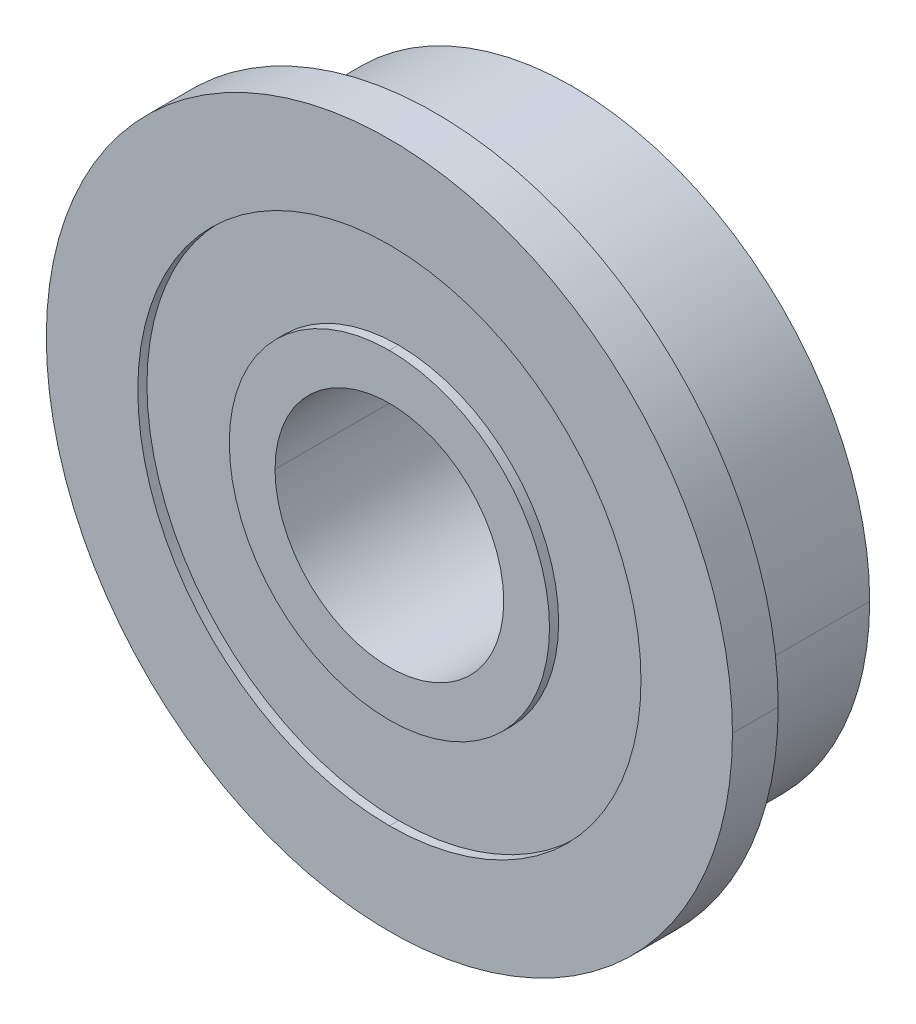
ISO-10303-21;
HEADER;
FILE_DESCRIPTION(('STEP AP214'),'2;1');
FILE_NAME('part.step','',(''),(''),'','','');
FILE_SCHEMA(('AUTOMOTIVE_DESIGN { 1 0 10303 214 1 1 1 1 }'));
ENDSEC;
DATA;
#1=APPLICATION_CONTEXT('core data for automotive mechanical design processes');
#2=APPLICATION_PROTOCOL_DEFINITION('international standard','automotive_design',2000,#1);
#3=PRODUCT_CONTEXT('',#1,'mechanical');
#4=PRODUCT('Part','Part','',(#3));
#5=PRODUCT_RELATED_PRODUCT_CATEGORY('part','',(#4));
#6=PRODUCT_DEFINITION_FORMATION('','',#4);
#7=PRODUCT_DEFINITION_CONTEXT('part definition',#1,'design');
#8=PRODUCT_DEFINITION('design','',#6,#7);
#9=PRODUCT_DEFINITION_SHAPE('','',#8);
#10=(LENGTH_UNIT() NAMED_UNIT(*) SI_UNIT(.MILLI.,.METRE.));
#11=(NAMED_UNIT(*) PLANE_ANGLE_UNIT() SI_UNIT($,.RADIAN.));
#12=(NAMED_UNIT(*) SI_UNIT($,.STERADIAN.) SOLID_ANGLE_UNIT());
#13=UNCERTAINTY_MEASURE_WITH_UNIT(LENGTH_MEASURE(1.E-05),#10,'distance_accuracy_value','');
#14=(GEOMETRIC_REPRESENTATION_CONTEXT(3) GLOBAL_UNCERTAINTY_ASSIGNED_CONTEXT((#13)) GLOBAL_UNIT_ASSIGNED_CONTEXT((#10,
#11,#12)) REPRESENTATION_CONTEXT('',''));
#15=CARTESIAN_POINT('',(0.,0.,0.));
#16=DIRECTION('',(0.,0.,1.));
#17=DIRECTION('',(1.,0.,0.));
#18=AXIS2_PLACEMENT_3D('',#15,#16,#17);
#19=CARTESIAN_POINT('',(0.,0.,2.));
#20=DIRECTION('',(0.,0.,-1.));
#21=DIRECTION('',(0.,1.,0.));
#22=AXIS2_PLACEMENT_3D('',#19,#20,#21);
#23=CYLINDRICAL_SURFACE('',#22,5.5);
#24=DIRECTION('',(0.,0.,1.));
#25=VECTOR('',#24,1.);
#26=CARTESIAN_POINT('',(0.,-5.5,1.8));
#27=LINE('',#26,#25);
#28=CARTESIAN_POINT('',(0.,-5.5,1.8));
#29=VERTEX_POINT('',#28);
#30=CARTESIAN_POINT('',(0.,-5.5,2.));
#31=VERTEX_POINT('',#30);
#32=EDGE_CURVE('E18',#29,#31,#27,.T.);
#33=ORIENTED_EDGE('',*,*,#32,.T.);
#34=CARTESIAN_POINT('',(0.,0.,2.));
#35=DIRECTION('',(0.,0.,-1.));
#36=DIRECTION('',(0.,1.,0.));
#37=AXIS2_PLACEMENT_3D('',#34,#35,#36);
#38=CIRCLE('',#37,5.5);
#39=CARTESIAN_POINT('',(0.,5.5,2.));
#40=VERTEX_POINT('',#39);
#41=EDGE_CURVE('E188',#40,#31,#38,.T.);
#42=ORIENTED_EDGE('',*,*,#41,.F.);
#43=DIRECTION('',(0.,0.,1.));
#44=VECTOR('',#43,1.);
#45=CARTESIAN_POINT('',(0.,5.5,1.8));
#46=LINE('',#45,#44);
#47=CARTESIAN_POINT('',(0.,5.5,1.8));
#48=VERTEX_POINT('',#47);
#49=EDGE_CURVE('E198',#48,#40,#46,.T.);
#50=ORIENTED_EDGE('',*,*,#49,.F.);
#51=CARTESIAN_POINT('',(0.,0.,1.8));
#52=DIRECTION('',(0.,0.,1.));
#53=DIRECTION('',(0.,-1.,0.));
#54=AXIS2_PLACEMENT_3D('',#51,#52,#53);
#55=CIRCLE('',#54,5.5);
#56=EDGE_CURVE('E191',#29,#48,#55,.T.);
#57=ORIENTED_EDGE('',*,*,#56,.F.);
#58=EDGE_LOOP('',(#33,#42,#50,#57));
#59=FACE_BOUND('',#58,.T.);
#60=ADVANCED_FACE('F15',(#59),#23,.F.);
#61=CARTESIAN_POINT('',(0.,0.,-2.));
#62=DIRECTION('',(0.,0.,1.));
#63=DIRECTION('',(1.,0.,0.));
#64=AXIS2_PLACEMENT_3D('',#61,#62,#63);
#65=CYLINDRICAL_SURFACE('',#64,2.5);
#66=CARTESIAN_POINT('',(0.,0.,2.));
#67=DIRECTION('',(0.,0.,-1.));
#68=DIRECTION('',(1.,0.,0.));
#69=AXIS2_PLACEMENT_3D('',#66,#67,#68);
#70=CIRCLE('',#69,2.5);
#71=CARTESIAN_POINT('',(2.5,0.,2.));
#72=VERTEX_POINT('',#71);
#73=CARTESIAN_POINT('',(-2.5,0.,2.));
#74=VERTEX_POINT('',#73);
#75=EDGE_CURVE('E165',#72,#74,#70,.T.);
#76=ORIENTED_EDGE('',*,*,#75,.F.);
#77=DIRECTION('',(0.,0.,-1.));
#78=VECTOR('',#77,1.);
#79=CARTESIAN_POINT('',(2.5,0.,2.));
#80=LINE('',#79,#78);
#81=CARTESIAN_POINT('',(2.5,0.,-2.));
#82=VERTEX_POINT('',#81);
#83=EDGE_CURVE('E24',#72,#82,#80,.T.);
#84=ORIENTED_EDGE('',*,*,#83,.T.);
#85=CARTESIAN_POINT('',(0.,0.,-2.));
#86=DIRECTION('',(0.,0.,1.));
#87=DIRECTION('',(-1.,0.,0.));
#88=AXIS2_PLACEMENT_3D('',#85,#86,#87);
#89=CIRCLE('',#88,2.5);
#90=CARTESIAN_POINT('',(-2.5,0.,-2.));
#91=VERTEX_POINT('',#90);
#92=EDGE_CURVE('E156',#91,#82,#89,.T.);
#93=ORIENTED_EDGE('',*,*,#92,.F.);
#94=DIRECTION('',(0.,0.,-1.));
#95=VECTOR('',#94,1.);
#96=CARTESIAN_POINT('',(-2.5,0.,2.));
#97=LINE('',#96,#95);
#98=EDGE_CURVE('E10',#74,#91,#97,.T.);
#99=ORIENTED_EDGE('',*,*,#98,.F.);
#100=EDGE_LOOP('',(#76,#84,#93,#99));
#101=FACE_BOUND('',#100,.T.);
#102=ADVANCED_FACE('F163',(#101),#65,.F.);
#103=CARTESIAN_POINT('',(0.,0.,-2.));
#104=DIRECTION('',(0.,0.,1.));
#105=DIRECTION('',(1.,0.,0.));
#106=AXIS2_PLACEMENT_3D('',#103,#104,#105);
#107=CYLINDRICAL_SURFACE('',#106,2.5);
#108=CARTESIAN_POINT('',(0.,0.,2.));
#109=DIRECTION('',(0.,0.,-1.));
#110=DIRECTION('',(-1.,0.,0.));
#111=AXIS2_PLACEMENT_3D('',#108,#109,#110);
#112=CIRCLE('',#111,2.5);
#113=EDGE_CURVE('E435',#74,#72,#112,.T.);
#114=ORIENTED_EDGE('',*,*,#113,.F.);
#115=ORIENTED_EDGE('',*,*,#98,.T.);
#116=CARTESIAN_POINT('',(0.,0.,-2.));
#117=DIRECTION('',(0.,0.,1.));
#118=DIRECTION('',(1.,0.,0.));
#119=AXIS2_PLACEMENT_3D('',#116,#117,#118);
#120=CIRCLE('',#119,2.5);
#121=EDGE_CURVE('E152',#82,#91,#120,.T.);
#122=ORIENTED_EDGE('',*,*,#121,.F.);
#123=ORIENTED_EDGE('',*,*,#83,.F.);
#124=EDGE_LOOP('',(#114,#115,#122,#123));
#125=FACE_BOUND('',#124,.T.);
#126=ADVANCED_FACE('F169',(#125),#107,.F.);
#127=CARTESIAN_POINT('',(0.,0.,-2.));
#128=DIRECTION('',(0.,0.,1.));
#129=DIRECTION('',(1.,0.,0.));
#130=AXIS2_PLACEMENT_3D('',#127,#128,#129);
#131=PLANE('',#130);
#132=ORIENTED_EDGE('',*,*,#92,.T.);
#133=ORIENTED_EDGE('',*,*,#121,.T.);
#134=EDGE_LOOP('',(#132,#133));
#135=FACE_BOUND('',#134,.T.);
#136=CARTESIAN_POINT('',(0.,0.,-2.));
#137=DIRECTION('',(0.,0.,-1.));
#138=DIRECTION('',(0.,-1.,0.));
#139=AXIS2_PLACEMENT_3D('',#136,#137,#138);
#140=CIRCLE('',#139,3.5);
#141=CARTESIAN_POINT('',(0.,-3.5,-2.));
#142=VERTEX_POINT('',#141);
#143=CARTESIAN_POINT('',(0.,3.5,-2.));
#144=VERTEX_POINT('',#143);
#145=EDGE_CURVE('E146',#142,#144,#140,.T.);
#146=ORIENTED_EDGE('',*,*,#145,.T.);
#147=CARTESIAN_POINT('',(0.,0.,-2.));
#148=DIRECTION('',(0.,0.,-1.));
#149=DIRECTION('',(0.,1.,0.));
#150=AXIS2_PLACEMENT_3D('',#147,#148,#149);
#151=CIRCLE('',#150,3.5);
#152=EDGE_CURVE('E31',#144,#142,#151,.T.);
#153=ORIENTED_EDGE('',*,*,#152,.T.);
#154=EDGE_LOOP('',(#146,#153));
#155=FACE_BOUND('',#154,.T.);
#156=ADVANCED_FACE('F171',(#135,#155),#131,.F.);
#157=CARTESIAN_POINT('',(0.,0.,-2.));
#158=DIRECTION('',(0.,0.,-1.));
#159=DIRECTION('',(0.,1.,0.));
#160=AXIS2_PLACEMENT_3D('',#157,#158,#159);
#161=CYLINDRICAL_SURFACE('',#160,3.5);
#162=CARTESIAN_POINT('',(0.,0.,-1.8));
#163=DIRECTION('',(0.,0.,1.));
#164=DIRECTION('',(0.,1.,0.));
#165=AXIS2_PLACEMENT_3D('',#162,#163,#164);
#166=CIRCLE('',#165,3.5);
#167=CARTESIAN_POINT('',(0.,3.5,-1.8));
#168=VERTEX_POINT('',#167);
#169=CARTESIAN_POINT('',(0.,-3.5,-1.8));
#170=VERTEX_POINT('',#169);
#171=EDGE_CURVE('E118',#168,#170,#166,.T.);
#172=ORIENTED_EDGE('',*,*,#171,.F.);
#173=DIRECTION('',(0.,0.,-1.));
#174=VECTOR('',#173,1.);
#175=CARTESIAN_POINT('',(0.,3.5,-1.8));
#176=LINE('',#175,#174);
#177=EDGE_CURVE('E121',#168,#144,#176,.T.);
#178=ORIENTED_EDGE('',*,*,#177,.T.);
#179=ORIENTED_EDGE('',*,*,#145,.F.);
#180=DIRECTION('',(0.,0.,-1.));
#181=VECTOR('',#180,1.);
#182=CARTESIAN_POINT('',(0.,-3.5,-1.8));
#183=LINE('',#182,#181);
#184=EDGE_CURVE('E123',#170,#142,#183,.T.);
#185=ORIENTED_EDGE('',*,*,#184,.F.);
#186=EDGE_LOOP('',(#172,#178,#179,#185));
#187=FACE_BOUND('',#186,.T.);
#188=ADVANCED_FACE('F120',(#187),#161,.T.);
#189=CARTESIAN_POINT('',(0.,0.,-2.));
#190=DIRECTION('',(0.,0.,-1.));
#191=DIRECTION('',(0.,1.,0.));
#192=AXIS2_PLACEMENT_3D('',#189,#190,#191);
#193=CYLINDRICAL_SURFACE('',#192,3.5);
#194=CARTESIAN_POINT('',(0.,0.,-1.8));
#195=DIRECTION('',(0.,0.,1.));
#196=DIRECTION('',(0.,-1.,0.));
#197=AXIS2_PLACEMENT_3D('',#194,#195,#196);
#198=CIRCLE('',#197,3.5);
#199=EDGE_CURVE('E128',#170,#168,#198,.T.);
#200=ORIENTED_EDGE('',*,*,#199,.F.);
#201=ORIENTED_EDGE('',*,*,#184,.T.);
#202=ORIENTED_EDGE('',*,*,#152,.F.);
#203=ORIENTED_EDGE('',*,*,#177,.F.);
#204=EDGE_LOOP('',(#200,#201,#202,#203));
#205=FACE_BOUND('',#204,.T.);
#206=ADVANCED_FACE('F131',(#205),#193,.T.);
#207=CARTESIAN_POINT('',(0.,0.,-1.8));
#208=DIRECTION('',(0.,0.,-1.));
#209=DIRECTION('',(0.,1.,0.));
#210=AXIS2_PLACEMENT_3D('',#207,#208,#209);
#211=PLANE('',#210);
#212=ORIENTED_EDGE('',*,*,#171,.T.);
#213=ORIENTED_EDGE('',*,*,#199,.T.);
#214=EDGE_LOOP('',(#212,#213));
#215=FACE_BOUND('',#214,.T.);
#216=CARTESIAN_POINT('',(0.,0.,-1.8));
#217=DIRECTION('',(0.,0.,-1.));
#218=DIRECTION('',(0.,1.,0.));
#219=AXIS2_PLACEMENT_3D('',#216,#217,#218);
#220=CIRCLE('',#219,5.5);
#221=CARTESIAN_POINT('',(0.,5.5,-1.8));
#222=VERTEX_POINT('',#221);
#223=CARTESIAN_POINT('',(0.,-5.5,-1.8));
#224=VERTEX_POINT('',#223);
#225=EDGE_CURVE('E137',#222,#224,#220,.T.);
#226=ORIENTED_EDGE('',*,*,#225,.T.);
#227=CARTESIAN_POINT('',(0.,0.,-1.8));
#228=DIRECTION('',(0.,0.,-1.));
#229=DIRECTION('',(0.,-1.,0.));
#230=AXIS2_PLACEMENT_3D('',#227,#228,#229);
#231=CIRCLE('',#230,5.5);
#232=EDGE_CURVE('E141',#224,#222,#231,.T.);
#233=ORIENTED_EDGE('',*,*,#232,.T.);
#234=EDGE_LOOP('',(#226,#233));
#235=FACE_BOUND('',#234,.T.);
#236=ADVANCED_FACE('F134',(#215,#235),#211,.T.);
#237=CARTESIAN_POINT('',(0.,0.,-2.));
#238=DIRECTION('',(0.,0.,-1.));
#239=DIRECTION('',(0.,1.,0.));
#240=AXIS2_PLACEMENT_3D('',#237,#238,#239);
#241=CYLINDRICAL_SURFACE('',#240,5.5);
#242=ORIENTED_EDGE('',*,*,#225,.F.);
#243=DIRECTION('',(0.,0.,-1.));
#244=VECTOR('',#243,1.);
#245=CARTESIAN_POINT('',(0.,5.5,-1.8));
#246=LINE('',#245,#244);
#247=CARTESIAN_POINT('',(0.,5.5,-2.));
#248=VERTEX_POINT('',#247);
#249=EDGE_CURVE('E260',#222,#248,#246,.T.);
#250=ORIENTED_EDGE('',*,*,#249,.T.);
#251=CARTESIAN_POINT('',(0.,0.,-2.));
#252=DIRECTION('',(0.,0.,1.));
#253=DIRECTION('',(0.,-1.,0.));
#254=AXIS2_PLACEMENT_3D('',#251,#252,#253);
#255=CIRCLE('',#254,5.5);
#256=CARTESIAN_POINT('',(0.,-5.5,-2.));
#257=VERTEX_POINT('',#256);
#258=EDGE_CURVE('E256',#257,#248,#255,.T.);
#259=ORIENTED_EDGE('',*,*,#258,.F.);
#260=DIRECTION('',(0.,0.,-1.));
#261=VECTOR('',#260,1.);
#262=CARTESIAN_POINT('',(0.,-5.5,-1.8));
#263=LINE('',#262,#261);
#264=EDGE_CURVE('E261',#224,#257,#263,.T.);
#265=ORIENTED_EDGE('',*,*,#264,.F.);
#266=EDGE_LOOP('',(#242,#250,#259,#265));
#267=FACE_BOUND('',#266,.T.);
#268=ADVANCED_FACE('F273',(#267),#241,.F.);
#269=CARTESIAN_POINT('',(0.,0.,-2.));
#270=DIRECTION('',(0.,0.,-1.));
#271=DIRECTION('',(0.,1.,0.));
#272=AXIS2_PLACEMENT_3D('',#269,#270,#271);
#273=CYLINDRICAL_SURFACE('',#272,5.5);
#274=ORIENTED_EDGE('',*,*,#232,.F.);
#275=ORIENTED_EDGE('',*,*,#264,.T.);
#276=CARTESIAN_POINT('',(0.,0.,-2.));
#277=DIRECTION('',(0.,0.,1.));
#278=DIRECTION('',(0.,1.,0.));
#279=AXIS2_PLACEMENT_3D('',#276,#277,#278);
#280=CIRCLE('',#279,5.5);
#281=EDGE_CURVE('E252',#248,#257,#280,.T.);
#282=ORIENTED_EDGE('',*,*,#281,.F.);
#283=ORIENTED_EDGE('',*,*,#249,.F.);
#284=EDGE_LOOP('',(#274,#275,#282,#283));
#285=FACE_BOUND('',#284,.T.);
#286=ADVANCED_FACE('F275',(#285),#273,.F.);
#287=CARTESIAN_POINT('',(0.,0.,-2.));
#288=DIRECTION('',(0.,0.,1.));
#289=DIRECTION('',(1.,0.,0.));
#290=AXIS2_PLACEMENT_3D('',#287,#288,#289);
#291=PLANE('',#290);
#292=ORIENTED_EDGE('',*,*,#258,.T.);
#293=ORIENTED_EDGE('',*,*,#281,.T.);
#294=EDGE_LOOP('',(#292,#293));
#295=FACE_BOUND('',#294,.T.);
#296=CARTESIAN_POINT('',(0.,0.,-2.));
#297=DIRECTION('',(0.,0.,-1.));
#298=DIRECTION('',(-1.,0.,0.));
#299=AXIS2_PLACEMENT_3D('',#296,#297,#298);
#300=CIRCLE('',#299,6.5);
#301=CARTESIAN_POINT('',(-6.5,0.,-2.));
#302=VERTEX_POINT('',#301);
#303=CARTESIAN_POINT('',(6.5,0.,-2.));
#304=VERTEX_POINT('',#303);
#305=EDGE_CURVE('E243',#302,#304,#300,.T.);
#306=ORIENTED_EDGE('',*,*,#305,.T.);
#307=CARTESIAN_POINT('',(0.,0.,-2.));
#308=DIRECTION('',(0.,0.,-1.));
#309=DIRECTION('',(1.,0.,0.));
#310=AXIS2_PLACEMENT_3D('',#307,#308,#309);
#311=CIRCLE('',#310,6.5);
#312=EDGE_CURVE('E244',#304,#302,#311,.T.);
#313=ORIENTED_EDGE('',*,*,#312,.T.);
#314=EDGE_LOOP('',(#306,#313));
#315=FACE_BOUND('',#314,.T.);
#316=ADVANCED_FACE('F277',(#295,#315),#291,.F.);
#317=CARTESIAN_POINT('',(0.,0.,-2.));
#318=DIRECTION('',(0.,0.,1.));
#319=DIRECTION('',(1.,0.,0.));
#320=AXIS2_PLACEMENT_3D('',#317,#318,#319);
#321=CYLINDRICAL_SURFACE('',#320,6.5);
#322=DIRECTION('',(0.,0.,-1.));
#323=VECTOR('',#322,1.);
#324=CARTESIAN_POINT('',(-6.5,0.,1.));
#325=LINE('',#324,#323);
#326=CARTESIAN_POINT('',(-6.5,0.,1.));
#327=VERTEX_POINT('',#326);
#328=EDGE_CURVE('E239',#327,#302,#325,.T.);
#329=ORIENTED_EDGE('',*,*,#328,.F.);
#330=CARTESIAN_POINT('',(0.,0.,1.));
#331=DIRECTION('',(0.,0.,1.));
#332=DIRECTION('',(1.,0.,0.));
#333=AXIS2_PLACEMENT_3D('',#330,#331,#332);
#334=CIRCLE('',#333,6.5);
#335=CARTESIAN_POINT('',(6.5,0.,1.));
#336=VERTEX_POINT('',#335);
#337=EDGE_CURVE('E234',#336,#327,#334,.T.);
#338=ORIENTED_EDGE('',*,*,#337,.F.);
#339=DIRECTION('',(0.,0.,-1.));
#340=VECTOR('',#339,1.);
#341=CARTESIAN_POINT('',(6.5,0.,1.));
#342=LINE('',#341,#340);
#343=EDGE_CURVE('E238',#336,#304,#342,.T.);
#344=ORIENTED_EDGE('',*,*,#343,.T.);
#345=ORIENTED_EDGE('',*,*,#305,.F.);
#346=EDGE_LOOP('',(#329,#338,#344,#345));
#347=FACE_BOUND('',#346,.T.);
#348=ADVANCED_FACE('F280',(#347),#321,.T.);
#349=CARTESIAN_POINT('',(0.,0.,-2.));
#350=DIRECTION('',(0.,0.,1.));
#351=DIRECTION('',(1.,0.,0.));
#352=AXIS2_PLACEMENT_3D('',#349,#350,#351);
#353=CYLINDRICAL_SURFACE('',#352,6.5);
#354=ORIENTED_EDGE('',*,*,#328,.T.);
#355=ORIENTED_EDGE('',*,*,#312,.F.);
#356=ORIENTED_EDGE('',*,*,#343,.F.);
#357=CARTESIAN_POINT('',(0.,0.,1.));
#358=DIRECTION('',(0.,0.,1.));
#359=DIRECTION('',(-1.,0.,0.));
#360=AXIS2_PLACEMENT_3D('',#357,#358,#359);
#361=CIRCLE('',#360,6.5);
#362=EDGE_CURVE('E230',#327,#336,#361,.T.);
#363=ORIENTED_EDGE('',*,*,#362,.F.);
#364=EDGE_LOOP('',(#354,#355,#356,#363));
#365=FACE_BOUND('',#364,.T.);
#366=ADVANCED_FACE('F288',(#365),#353,.T.);
#367=CARTESIAN_POINT('',(0.,0.,1.));
#368=DIRECTION('',(0.,0.,1.));
#369=DIRECTION('',(1.,0.,0.));
#370=AXIS2_PLACEMENT_3D('',#367,#368,#369);
#371=PLANE('',#370);
#372=ORIENTED_EDGE('',*,*,#337,.T.);
#373=ORIENTED_EDGE('',*,*,#362,.T.);
#374=EDGE_LOOP('',(#372,#373));
#375=FACE_BOUND('',#374,.T.);
#376=CARTESIAN_POINT('',(0.,0.,0.999999999999999));
#377=DIRECTION('',(0.,0.,-1.));
#378=DIRECTION('',(-1.,0.,0.));
#379=AXIS2_PLACEMENT_3D('',#376,#377,#378);
#380=CIRCLE('',#379,7.5);
#381=CARTESIAN_POINT('',(-7.5,0.,1.));
#382=VERTEX_POINT('',#381);
#383=CARTESIAN_POINT('',(7.5,0.,1.));
#384=VERTEX_POINT('',#383);
#385=EDGE_CURVE('E38',#382,#384,#380,.T.);
#386=ORIENTED_EDGE('',*,*,#385,.T.);
#387=CARTESIAN_POINT('',(0.,0.,0.999999999999999));
#388=DIRECTION('',(0.,0.,-1.));
#389=DIRECTION('',(1.,0.,0.));
#390=AXIS2_PLACEMENT_3D('',#387,#388,#389);
#391=CIRCLE('',#390,7.5);
#392=EDGE_CURVE('E225',#384,#382,#391,.T.);
#393=ORIENTED_EDGE('',*,*,#392,.T.);
#394=EDGE_LOOP('',(#386,#393));
#395=FACE_BOUND('',#394,.T.);
#396=ADVANCED_FACE('F290',(#375,#395),#371,.F.);
#397=CARTESIAN_POINT('',(0.,0.,2.));
#398=DIRECTION('',(0.,0.,1.));
#399=DIRECTION('',(1.,0.,0.));
#400=AXIS2_PLACEMENT_3D('',#397,#398,#399);
#401=CYLINDRICAL_SURFACE('',#400,7.5);
#402=ORIENTED_EDGE('',*,*,#385,.F.);
#403=DIRECTION('',(0.,0.,-1.));
#404=VECTOR('',#403,1.);
#405=CARTESIAN_POINT('',(-7.5,0.,2.));
#406=LINE('',#405,#404);
#407=CARTESIAN_POINT('',(-7.5,0.,2.));
#408=VERTEX_POINT('',#407);
#409=EDGE_CURVE('E205',#408,#382,#406,.T.);
#410=ORIENTED_EDGE('',*,*,#409,.F.);
#411=CARTESIAN_POINT('',(0.,0.,2.));
#412=DIRECTION('',(0.,0.,1.));
#413=DIRECTION('',(1.,0.,0.));
#414=AXIS2_PLACEMENT_3D('',#411,#412,#413);
#415=CIRCLE('',#414,7.5);
#416=CARTESIAN_POINT('',(7.5,0.,2.));
#417=VERTEX_POINT('',#416);
#418=EDGE_CURVE('E206',#417,#408,#415,.T.);
#419=ORIENTED_EDGE('',*,*,#418,.F.);
#420=DIRECTION('',(0.,0.,-1.));
#421=VECTOR('',#420,1.);
#422=CARTESIAN_POINT('',(7.5,0.,2.));
#423=LINE('',#422,#421);
#424=EDGE_CURVE('E222',#417,#384,#423,.T.);
#425=ORIENTED_EDGE('',*,*,#424,.T.);
#426=EDGE_LOOP('',(#402,#410,#419,#425));
#427=FACE_BOUND('',#426,.T.);
#428=ADVANCED_FACE('F292',(#427),#401,.T.);
#429=CARTESIAN_POINT('',(0.,0.,2.));
#430=DIRECTION('',(0.,0.,1.));
#431=DIRECTION('',(1.,0.,0.));
#432=AXIS2_PLACEMENT_3D('',#429,#430,#431);
#433=CYLINDRICAL_SURFACE('',#432,7.5);
#434=ORIENTED_EDGE('',*,*,#392,.F.);
#435=ORIENTED_EDGE('',*,*,#424,.F.);
#436=CARTESIAN_POINT('',(0.,0.,2.));
#437=DIRECTION('',(0.,0.,1.));
#438=DIRECTION('',(-1.,0.,0.));
#439=AXIS2_PLACEMENT_3D('',#436,#437,#438);
#440=CIRCLE('',#439,7.5);
#441=EDGE_CURVE('E197',#408,#417,#440,.T.);
#442=ORIENTED_EDGE('',*,*,#441,.F.);
#443=ORIENTED_EDGE('',*,*,#409,.T.);
#444=EDGE_LOOP('',(#434,#435,#442,#443));
#445=FACE_BOUND('',#444,.T.);
#446=ADVANCED_FACE('F298',(#445),#433,.T.);
#447=CARTESIAN_POINT('',(0.,0.,2.));
#448=DIRECTION('',(0.,0.,1.));
#449=DIRECTION('',(1.,0.,0.));
#450=AXIS2_PLACEMENT_3D('',#447,#448,#449);
#451=PLANE('',#450);
#452=ORIENTED_EDGE('',*,*,#41,.T.);
#453=CARTESIAN_POINT('',(0.,0.,2.));
#454=DIRECTION('',(0.,0.,-1.));
#455=DIRECTION('',(0.,-1.,0.));
#456=AXIS2_PLACEMENT_3D('',#453,#454,#455);
#457=CIRCLE('',#456,5.5);
#458=EDGE_CURVE('E202',#31,#40,#457,.T.);
#459=ORIENTED_EDGE('',*,*,#458,.T.);
#460=EDGE_LOOP('',(#452,#459));
#461=FACE_BOUND('',#460,.T.);
#462=ORIENTED_EDGE('',*,*,#418,.T.);
#463=ORIENTED_EDGE('',*,*,#441,.T.);
#464=EDGE_LOOP('',(#462,#463));
#465=FACE_BOUND('',#464,.T.);
#466=ADVANCED_FACE('F200',(#461,#465),#451,.T.);
#467=CARTESIAN_POINT('',(0.,0.,2.));
#468=DIRECTION('',(0.,0.,-1.));
#469=DIRECTION('',(0.,1.,0.));
#470=AXIS2_PLACEMENT_3D('',#467,#468,#469);
#471=CYLINDRICAL_SURFACE('',#470,5.5);
#472=ORIENTED_EDGE('',*,*,#32,.F.);
#473=CARTESIAN_POINT('',(0.,0.,1.8));
#474=DIRECTION('',(0.,0.,1.));
#475=DIRECTION('',(0.,1.,0.));
#476=AXIS2_PLACEMENT_3D('',#473,#474,#475);
#477=CIRCLE('',#476,5.5);
#478=EDGE_CURVE('E214',#48,#29,#477,.T.);
#479=ORIENTED_EDGE('',*,*,#478,.F.);
#480=ORIENTED_EDGE('',*,*,#49,.T.);
#481=ORIENTED_EDGE('',*,*,#458,.F.);
#482=EDGE_LOOP('',(#472,#479,#480,#481));
#483=FACE_BOUND('',#482,.T.);
#484=ADVANCED_FACE('F208',(#483),#471,.F.);
#485=CARTESIAN_POINT('',(0.,0.,1.8));
#486=DIRECTION('',(0.,0.,-1.));
#487=DIRECTION('',(0.,1.,0.));
#488=AXIS2_PLACEMENT_3D('',#485,#486,#487);
#489=PLANE('',#488);
#490=CARTESIAN_POINT('',(0.,0.,1.8));
#491=DIRECTION('',(0.,0.,-1.));
#492=DIRECTION('',(0.,-1.,0.));
#493=AXIS2_PLACEMENT_3D('',#490,#491,#492);
#494=CIRCLE('',#493,3.5);
#495=CARTESIAN_POINT('',(0.,-3.5,1.8));
#496=VERTEX_POINT('',#495);
#497=CARTESIAN_POINT('',(0.,3.5,1.8));
#498=VERTEX_POINT('',#497);
#499=EDGE_CURVE('E451',#496,#498,#494,.T.);
#500=ORIENTED_EDGE('',*,*,#499,.T.);
#501=CARTESIAN_POINT('',(0.,0.,1.8));
#502=DIRECTION('',(0.,0.,-1.));
#503=DIRECTION('',(0.,1.,0.));
#504=AXIS2_PLACEMENT_3D('',#501,#502,#503);
#505=CIRCLE('',#504,3.5);
#506=EDGE_CURVE('E447',#498,#496,#505,.T.);
#507=ORIENTED_EDGE('',*,*,#506,.T.);
#508=EDGE_LOOP('',(#500,#507));
#509=FACE_BOUND('',#508,.T.);
#510=ORIENTED_EDGE('',*,*,#56,.T.);
#511=ORIENTED_EDGE('',*,*,#478,.T.);
#512=EDGE_LOOP('',(#510,#511));
#513=FACE_BOUND('',#512,.T.);
#514=ADVANCED_FACE('F381',(#509,#513),#489,.F.);
#515=CARTESIAN_POINT('',(0.,0.,2.));
#516=DIRECTION('',(0.,0.,-1.));
#517=DIRECTION('',(0.,1.,0.));
#518=AXIS2_PLACEMENT_3D('',#515,#516,#517);
#519=CYLINDRICAL_SURFACE('',#518,3.5);
#520=DIRECTION('',(0.,0.,1.));
#521=VECTOR('',#520,1.);
#522=CARTESIAN_POINT('',(0.,-3.5,1.8));
#523=LINE('',#522,#521);
#524=CARTESIAN_POINT('',(0.,-3.5,2.));
#525=VERTEX_POINT('',#524);
#526=EDGE_CURVE('E448',#496,#525,#523,.T.);
#527=ORIENTED_EDGE('',*,*,#526,.T.);
#528=CARTESIAN_POINT('',(0.,0.,2.));
#529=DIRECTION('',(0.,0.,1.));
#530=DIRECTION('',(0.,1.,0.));
#531=AXIS2_PLACEMENT_3D('',#528,#529,#530);
#532=CIRCLE('',#531,3.5);
#533=CARTESIAN_POINT('',(0.,3.5,2.));
#534=VERTEX_POINT('',#533);
#535=EDGE_CURVE('E429',#534,#525,#532,.T.);
#536=ORIENTED_EDGE('',*,*,#535,.F.);
#537=DIRECTION('',(0.,0.,1.));
#538=VECTOR('',#537,1.);
#539=CARTESIAN_POINT('',(0.,3.5,1.8));
#540=LINE('',#539,#538);
#541=EDGE_CURVE('E444',#498,#534,#540,.T.);
#542=ORIENTED_EDGE('',*,*,#541,.F.);
#543=ORIENTED_EDGE('',*,*,#499,.F.);
#544=EDGE_LOOP('',(#527,#536,#542,#543));
#545=FACE_BOUND('',#544,.T.);
#546=ADVANCED_FACE('F390',(#545),#519,.T.);
#547=CARTESIAN_POINT('',(0.,0.,2.));
#548=DIRECTION('',(0.,0.,-1.));
#549=DIRECTION('',(0.,1.,0.));
#550=AXIS2_PLACEMENT_3D('',#547,#548,#549);
#551=CYLINDRICAL_SURFACE('',#550,3.5);
#552=ORIENTED_EDGE('',*,*,#526,.F.);
#553=ORIENTED_EDGE('',*,*,#506,.F.);
#554=ORIENTED_EDGE('',*,*,#541,.T.);
#555=CARTESIAN_POINT('',(0.,0.,2.));
#556=DIRECTION('',(0.,0.,1.));
#557=DIRECTION('',(0.,-1.,0.));
#558=AXIS2_PLACEMENT_3D('',#555,#556,#557);
#559=CIRCLE('',#558,3.5);
#560=EDGE_CURVE('E431',#525,#534,#559,.T.);
#561=ORIENTED_EDGE('',*,*,#560,.F.);
#562=EDGE_LOOP('',(#552,#553,#554,#561));
#563=FACE_BOUND('',#562,.T.);
#564=ADVANCED_FACE('F400',(#563),#551,.T.);
#565=CARTESIAN_POINT('',(0.,0.,2.));
#566=DIRECTION('',(0.,0.,1.));
#567=DIRECTION('',(1.,0.,0.));
#568=AXIS2_PLACEMENT_3D('',#565,#566,#567);
#569=PLANE('',#568);
#570=ORIENTED_EDGE('',*,*,#75,.T.);
#571=ORIENTED_EDGE('',*,*,#113,.T.);
#572=EDGE_LOOP('',(#570,#571));
#573=FACE_BOUND('',#572,.T.);
#574=ORIENTED_EDGE('',*,*,#535,.T.);
#575=ORIENTED_EDGE('',*,*,#560,.T.);
#576=EDGE_LOOP('',(#574,#575));
#577=FACE_BOUND('',#576,.T.);
#578=ADVANCED_FACE('F410',(#573,#577),#569,.T.);
#579=CLOSED_SHELL('',(#60,#102,#126,#156,#188,#206,#236,#268,#286,#316,#348,#366,#396,#428,#446,
#466,#484,#514,#546,#564,#578));
#580=MANIFOLD_SOLID_BREP('B1',#579);
#581=ADVANCED_BREP_SHAPE_REPRESENTATION('',(#18,#580),#14);
#582=SHAPE_DEFINITION_REPRESENTATION(#9,#581);
ENDSEC;
END-ISO-10303-21;
